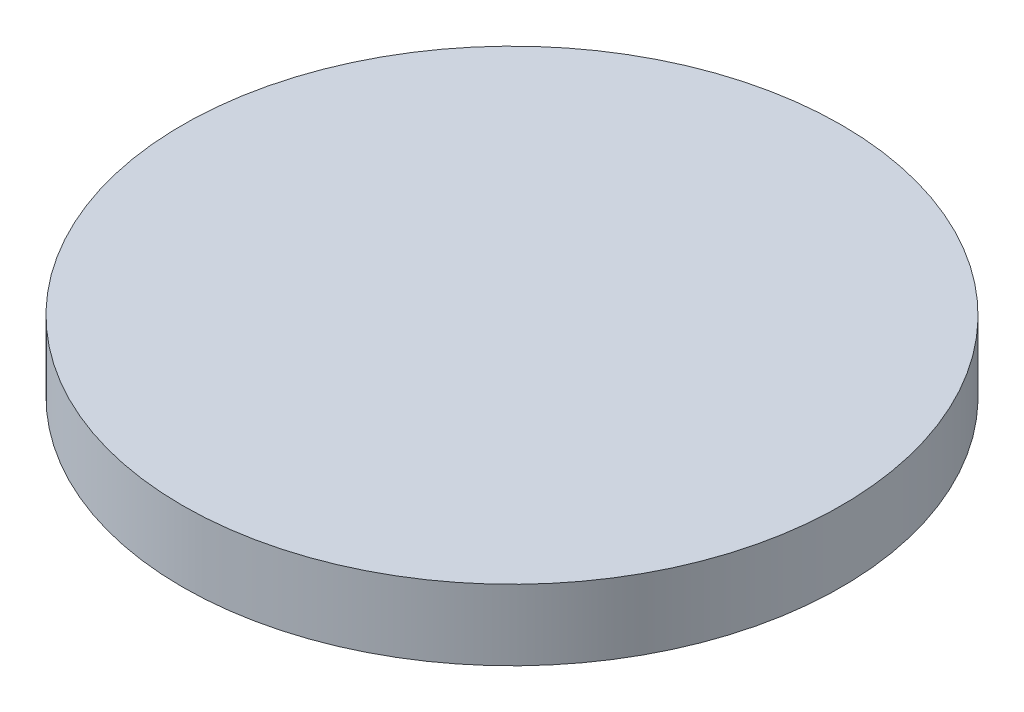
ISO-10303-21;
HEADER;
FILE_DESCRIPTION(('STEP AP214'),'2;1');
FILE_NAME('part.step','',(''),(''),'','','');
FILE_SCHEMA(('AUTOMOTIVE_DESIGN { 1 0 10303 214 1 1 1 1 }'));
ENDSEC;
DATA;
#1=APPLICATION_CONTEXT('core data for automotive mechanical design processes');
#2=APPLICATION_PROTOCOL_DEFINITION('international standard','automotive_design',2000,#1);
#3=PRODUCT_CONTEXT('',#1,'mechanical');
#4=PRODUCT('Part','Part','',(#3));
#5=PRODUCT_RELATED_PRODUCT_CATEGORY('part','',(#4));
#6=PRODUCT_DEFINITION_FORMATION('','',#4);
#7=PRODUCT_DEFINITION_CONTEXT('part definition',#1,'design');
#8=PRODUCT_DEFINITION('design','',#6,#7);
#9=PRODUCT_DEFINITION_SHAPE('','',#8);
#10=(LENGTH_UNIT() NAMED_UNIT(*) SI_UNIT(.MILLI.,.METRE.));
#11=(NAMED_UNIT(*) PLANE_ANGLE_UNIT() SI_UNIT($,.RADIAN.));
#12=(NAMED_UNIT(*) SI_UNIT($,.STERADIAN.) SOLID_ANGLE_UNIT());
#13=UNCERTAINTY_MEASURE_WITH_UNIT(LENGTH_MEASURE(1.E-05),#10,'distance_accuracy_value','');
#14=(GEOMETRIC_REPRESENTATION_CONTEXT(3) GLOBAL_UNCERTAINTY_ASSIGNED_CONTEXT((#13)) GLOBAL_UNIT_ASSIGNED_CONTEXT((#10,
#11,#12)) REPRESENTATION_CONTEXT('',''));
#15=CARTESIAN_POINT('',(0.,0.,0.));
#16=DIRECTION('',(0.,0.,1.));
#17=DIRECTION('',(1.,0.,0.));
#18=AXIS2_PLACEMENT_3D('',#15,#16,#17);
#19=CARTESIAN_POINT('',(0.,0.762,0.));
#20=DIRECTION('',(0.,-1.,0.));
#21=DIRECTION('',(0.,0.,-1.));
#22=AXIS2_PLACEMENT_3D('',#19,#20,#21);
#23=CYLINDRICAL_SURFACE('',#22,3.556);
#24=CARTESIAN_POINT('',(0.,0.762,0.));
#25=DIRECTION('',(0.,1.,0.));
#26=DIRECTION('',(0.,0.,1.));
#27=AXIS2_PLACEMENT_3D('',#24,#25,#26);
#28=CIRCLE('',#27,3.556);
#29=CARTESIAN_POINT('',(0.,0.762,3.556));
#30=VERTEX_POINT('',#29);
#31=EDGE_CURVE('E10',#30,#30,#28,.T.);
#32=ORIENTED_EDGE('',*,*,#31,.F.);
#33=EDGE_LOOP('',(#32));
#34=FACE_BOUND('',#33,.T.);
#35=CARTESIAN_POINT('',(0.,0.,0.));
#36=DIRECTION('',(0.,1.,0.));
#37=DIRECTION('',(0.,0.,1.));
#38=AXIS2_PLACEMENT_3D('',#35,#36,#37);
#39=CIRCLE('',#38,3.556);
#40=CARTESIAN_POINT('',(0.,0.,3.556));
#41=VERTEX_POINT('',#40);
#42=EDGE_CURVE('E46',#41,#41,#39,.T.);
#43=ORIENTED_EDGE('',*,*,#42,.T.);
#44=EDGE_LOOP('',(#43));
#45=FACE_BOUND('',#44,.T.);
#46=ADVANCED_FACE('F43',(#34,#45),#23,.T.);
#47=CARTESIAN_POINT('',(0.,0.762,0.));
#48=DIRECTION('',(0.,1.,0.));
#49=DIRECTION('',(0.,0.,1.));
#50=AXIS2_PLACEMENT_3D('',#47,#48,#49);
#51=PLANE('',#50);
#52=ORIENTED_EDGE('',*,*,#31,.T.);
#53=EDGE_LOOP('',(#52));
#54=FACE_BOUND('',#53,.T.);
#55=ADVANCED_FACE('F58',(#54),#51,.T.);
#56=CARTESIAN_POINT('',(0.,0.,0.));
#57=DIRECTION('',(0.,1.,0.));
#58=DIRECTION('',(0.,0.,1.));
#59=AXIS2_PLACEMENT_3D('',#56,#57,#58);
#60=PLANE('',#59);
#61=ORIENTED_EDGE('',*,*,#42,.F.);
#62=EDGE_LOOP('',(#61));
#63=FACE_BOUND('',#62,.T.);
#64=ADVANCED_FACE('F56',(#63),#60,.F.);
#65=CLOSED_SHELL('',(#46,#55,#64));
#66=MANIFOLD_SOLID_BREP('B2',#65);
#67=ADVANCED_BREP_SHAPE_REPRESENTATION('',(#18,#66),#14);
#68=SHAPE_DEFINITION_REPRESENTATION(#9,#67);
ENDSEC;
END-ISO-10303-21;
